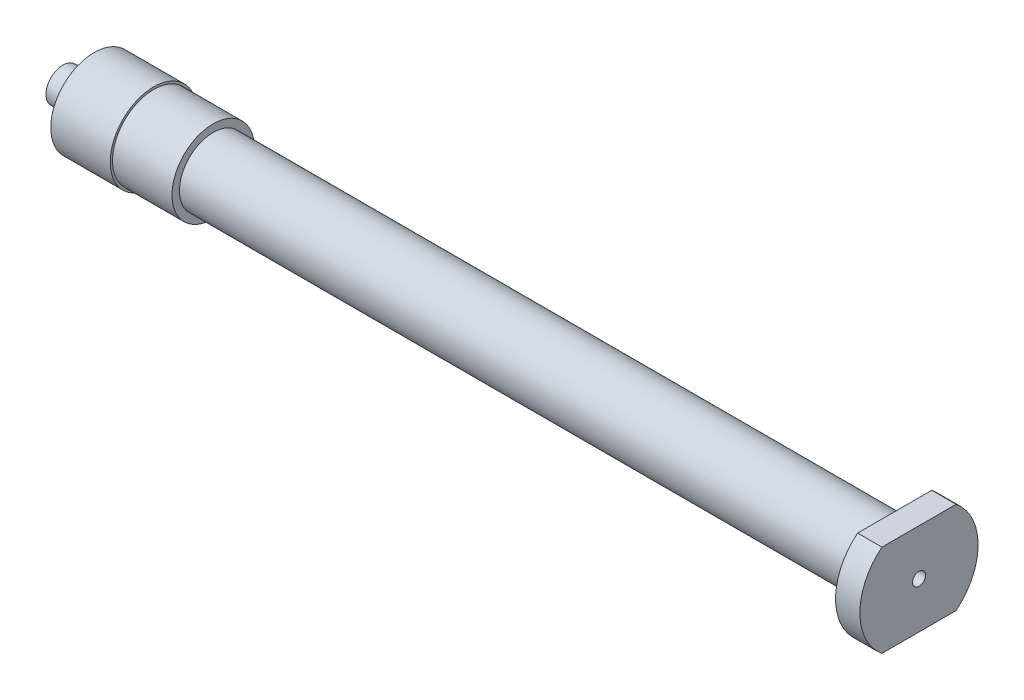
ISO-10303-21;
HEADER;
FILE_DESCRIPTION(('STEP AP214'),'2;1');
FILE_NAME('part.step','',(''),(''),'','','');
FILE_SCHEMA(('AUTOMOTIVE_DESIGN { 1 0 10303 214 1 1 1 1 }'));
ENDSEC;
DATA;
#1=APPLICATION_CONTEXT('core data for automotive mechanical design processes');
#2=APPLICATION_PROTOCOL_DEFINITION('international standard','automotive_design',2000,#1);
#3=PRODUCT_CONTEXT('',#1,'mechanical');
#4=PRODUCT('Part','Part','',(#3));
#5=PRODUCT_RELATED_PRODUCT_CATEGORY('part','',(#4));
#6=PRODUCT_DEFINITION_FORMATION('','',#4);
#7=PRODUCT_DEFINITION_CONTEXT('part definition',#1,'design');
#8=PRODUCT_DEFINITION('design','',#6,#7);
#9=PRODUCT_DEFINITION_SHAPE('','',#8);
#10=(LENGTH_UNIT() NAMED_UNIT(*) SI_UNIT(.MILLI.,.METRE.));
#11=(NAMED_UNIT(*) PLANE_ANGLE_UNIT() SI_UNIT($,.RADIAN.));
#12=(NAMED_UNIT(*) SI_UNIT($,.STERADIAN.) SOLID_ANGLE_UNIT());
#13=UNCERTAINTY_MEASURE_WITH_UNIT(LENGTH_MEASURE(1.E-05),#10,'distance_accuracy_value','');
#14=(GEOMETRIC_REPRESENTATION_CONTEXT(3) GLOBAL_UNCERTAINTY_ASSIGNED_CONTEXT((#13)) GLOBAL_UNIT_ASSIGNED_CONTEXT((#10,
#11,#12)) REPRESENTATION_CONTEXT('',''));
#15=CARTESIAN_POINT('',(0.,0.,0.));
#16=DIRECTION('',(0.,0.,1.));
#17=DIRECTION('',(1.,0.,0.));
#18=AXIS2_PLACEMENT_3D('',#15,#16,#17);
#19=CARTESIAN_POINT('',(49.2849999999998,0.,-6.805));
#20=DIRECTION('',(1.,0.,0.));
#21=DIRECTION('',(0.,0.,-1.));
#22=AXIS2_PLACEMENT_3D('',#19,#20,#21);
#23=PLANE('',#22);
#24=CARTESIAN_POINT('',(49.2849999999998,0.,0.));
#25=DIRECTION('',(1.,0.,0.));
#26=DIRECTION('',(0.,0.,-1.));
#27=AXIS2_PLACEMENT_3D('',#24,#25,#26);
#28=CIRCLE('',#27,0.75);
#29=CARTESIAN_POINT('',(49.2849999999998,0.,-0.75));
#30=VERTEX_POINT('',#29);
#31=EDGE_CURVE('E98',#30,#30,#28,.T.);
#32=ORIENTED_EDGE('',*,*,#31,.F.);
#33=EDGE_LOOP('',(#32));
#34=FACE_BOUND('',#33,.T.);
#35=CARTESIAN_POINT('',(49.2849999999998,0.,0.));
#36=DIRECTION('',(1.,0.,0.));
#37=DIRECTION('',(0.,0.,-1.));
#38=AXIS2_PLACEMENT_3D('',#35,#36,#37);
#39=CIRCLE('',#38,6.805);
#40=CARTESIAN_POINT('',(49.2849999999998,5.3,4.26825784132121));
#41=VERTEX_POINT('',#40);
#42=CARTESIAN_POINT('',(49.2849999999998,-5.3,4.26825784132121));
#43=VERTEX_POINT('',#42);
#44=EDGE_CURVE('E86',#41,#43,#39,.T.);
#45=ORIENTED_EDGE('',*,*,#44,.T.);
#46=DIRECTION('',(0.,0.,-1.));
#47=VECTOR('',#46,1.);
#48=CARTESIAN_POINT('',(49.2849999999998,-5.3,7.50000000000001));
#49=LINE('',#48,#47);
#50=CARTESIAN_POINT('',(49.2849999999998,-5.3,-4.26825784132121));
#51=VERTEX_POINT('',#50);
#52=EDGE_CURVE('E358',#43,#51,#49,.T.);
#53=ORIENTED_EDGE('',*,*,#52,.T.);
#54=CARTESIAN_POINT('',(49.2849999999998,5.3,-4.26825784132121));
#55=VERTEX_POINT('',#54);
#56=EDGE_CURVE('E89',#51,#55,#39,.T.);
#57=ORIENTED_EDGE('',*,*,#56,.T.);
#58=DIRECTION('',(0.,0.,1.));
#59=VECTOR('',#58,1.);
#60=CARTESIAN_POINT('',(49.2849999999998,5.3,7.50000000000001));
#61=LINE('',#60,#59);
#62=EDGE_CURVE('E356',#55,#41,#61,.T.);
#63=ORIENTED_EDGE('',*,*,#62,.T.);
#64=EDGE_LOOP('',(#45,#53,#57,#63));
#65=FACE_BOUND('',#64,.T.);
#66=ADVANCED_FACE('F34',(#34,#65),#23,.T.);
#67=CARTESIAN_POINT('',(49.2849999999998,0.,0.));
#68=DIRECTION('',(1.,0.,0.));
#69=DIRECTION('',(0.,0.,-1.));
#70=AXIS2_PLACEMENT_3D('',#67,#68,#69);
#71=CYLINDRICAL_SURFACE('',#70,6.805);
#72=ORIENTED_EDGE('',*,*,#56,.F.);
#73=DIRECTION('',(1.,0.,0.));
#74=VECTOR('',#73,1.);
#75=CARTESIAN_POINT('',(49.2849999999998,-5.3,-4.26825784132121));
#76=LINE('',#75,#74);
#77=CARTESIAN_POINT('',(46.4849999999998,-5.3,-4.26825784132121));
#78=VERTEX_POINT('',#77);
#79=EDGE_CURVE('E351',#51,#78,#76,.F.);
#80=ORIENTED_EDGE('',*,*,#79,.T.);
#81=CARTESIAN_POINT('',(46.4849999999998,0.,0.));
#82=DIRECTION('',(1.,0.,0.));
#83=DIRECTION('',(0.,0.,-1.));
#84=AXIS2_PLACEMENT_3D('',#81,#82,#83);
#85=CIRCLE('',#84,6.805);
#86=CARTESIAN_POINT('',(46.4849999999998,5.3,-4.26825784132121));
#87=VERTEX_POINT('',#86);
#88=EDGE_CURVE('E90',#78,#87,#85,.T.);
#89=ORIENTED_EDGE('',*,*,#88,.T.);
#90=DIRECTION('',(1.,0.,0.));
#91=VECTOR('',#90,1.);
#92=CARTESIAN_POINT('',(49.2849999999998,5.3,-4.26825784132121));
#93=LINE('',#92,#91);
#94=EDGE_CURVE('E56',#87,#55,#93,.T.);
#95=ORIENTED_EDGE('',*,*,#94,.T.);
#96=EDGE_LOOP('',(#72,#80,#89,#95));
#97=FACE_BOUND('',#96,.T.);
#98=ADVANCED_FACE('F139',(#97),#71,.T.);
#99=CARTESIAN_POINT('',(46.4849999999998,5.3,4.26825784132121));
#100=VERTEX_POINT('',#99);
#101=CARTESIAN_POINT('',(46.4849999999998,-5.3,4.26825784132121));
#102=VERTEX_POINT('',#101);
#103=EDGE_CURVE('E84',#100,#102,#85,.T.);
#104=ORIENTED_EDGE('',*,*,#103,.T.);
#105=DIRECTION('',(1.,0.,0.));
#106=VECTOR('',#105,1.);
#107=CARTESIAN_POINT('',(49.2849999999998,-5.3,4.26825784132121));
#108=LINE('',#107,#106);
#109=EDGE_CURVE('E49',#102,#43,#108,.T.);
#110=ORIENTED_EDGE('',*,*,#109,.T.);
#111=ORIENTED_EDGE('',*,*,#44,.F.);
#112=DIRECTION('',(1.,0.,0.));
#113=VECTOR('',#112,1.);
#114=CARTESIAN_POINT('',(49.2849999999998,5.3,4.26825784132121));
#115=LINE('',#114,#113);
#116=EDGE_CURVE('E73',#41,#100,#115,.F.);
#117=ORIENTED_EDGE('',*,*,#116,.T.);
#118=EDGE_LOOP('',(#104,#110,#111,#117));
#119=FACE_BOUND('',#118,.T.);
#120=ADVANCED_FACE('F83',(#119),#71,.T.);
#121=CARTESIAN_POINT('',(46.4849999999998,0.,-3.88499999999999));
#122=DIRECTION('',(-1.,0.,0.));
#123=DIRECTION('',(0.,0.,1.));
#124=AXIS2_PLACEMENT_3D('',#121,#122,#123);
#125=PLANE('',#124);
#126=CARTESIAN_POINT('',(46.4849999999999,0.,0.));
#127=DIRECTION('',(1.,0.,0.));
#128=DIRECTION('',(0.,0.,-1.));
#129=AXIS2_PLACEMENT_3D('',#126,#127,#128);
#130=CIRCLE('',#129,3.88499999999999);
#131=CARTESIAN_POINT('',(46.4849999999999,0.,-3.88499999999999));
#132=VERTEX_POINT('',#131);
#133=EDGE_CURVE('E94',#132,#132,#130,.T.);
#134=ORIENTED_EDGE('',*,*,#133,.T.);
#135=EDGE_LOOP('',(#134));
#136=FACE_BOUND('',#135,.T.);
#137=ORIENTED_EDGE('',*,*,#88,.F.);
#138=DIRECTION('',(0.,0.,1.));
#139=VECTOR('',#138,1.);
#140=CARTESIAN_POINT('',(46.4849999999998,-5.3,-3.88499999999999));
#141=LINE('',#140,#139);
#142=EDGE_CURVE('E11',#78,#102,#141,.T.);
#143=ORIENTED_EDGE('',*,*,#142,.T.);
#144=ORIENTED_EDGE('',*,*,#103,.F.);
#145=DIRECTION('',(0.,0.,-1.));
#146=VECTOR('',#145,1.);
#147=CARTESIAN_POINT('',(46.4849999999998,5.3,-3.88499999999999));
#148=LINE('',#147,#146);
#149=EDGE_CURVE('E42',#100,#87,#148,.T.);
#150=ORIENTED_EDGE('',*,*,#149,.T.);
#151=EDGE_LOOP('',(#137,#143,#144,#150));
#152=FACE_BOUND('',#151,.T.);
#153=ADVANCED_FACE('F88',(#136,#152),#125,.T.);
#154=CARTESIAN_POINT('',(49.2849999999998,0.,0.));
#155=DIRECTION('',(1.,0.,0.));
#156=DIRECTION('',(0.,0.,-1.));
#157=AXIS2_PLACEMENT_3D('',#154,#155,#156);
#158=CYLINDRICAL_SURFACE('',#157,5.);
#159=CARTESIAN_POINT('',(-45.6850000000002,0.,0.));
#160=DIRECTION('',(1.,0.,0.));
#161=DIRECTION('',(0.,0.,-1.));
#162=AXIS2_PLACEMENT_3D('',#159,#160,#161);
#163=CIRCLE('',#162,5.00000000000001);
#164=CARTESIAN_POINT('',(-45.6850000000002,0.,-5.));
#165=VERTEX_POINT('',#164);
#166=EDGE_CURVE('E79',#165,#165,#163,.T.);
#167=ORIENTED_EDGE('',*,*,#166,.T.);
#168=EDGE_LOOP('',(#167));
#169=FACE_BOUND('',#168,.T.);
#170=CARTESIAN_POINT('',(-38.8350000000002,0.,0.));
#171=DIRECTION('',(1.,0.,0.));
#172=DIRECTION('',(0.,0.,-1.));
#173=AXIS2_PLACEMENT_3D('',#170,#171,#172);
#174=CIRCLE('',#173,4.99999999999999);
#175=CARTESIAN_POINT('',(-38.8350000000002,0.,-4.99999999999998));
#176=VERTEX_POINT('',#175);
#177=EDGE_CURVE('E348',#176,#176,#174,.T.);
#178=ORIENTED_EDGE('',*,*,#177,.F.);
#179=EDGE_LOOP('',(#178));
#180=FACE_BOUND('',#179,.T.);
#181=ADVANCED_FACE('F36',(#169,#180),#158,.T.);
#182=CARTESIAN_POINT('',(-45.6850000000002,0.,-4.09999999999998));
#183=DIRECTION('',(-1.,0.,0.));
#184=DIRECTION('',(0.,0.,1.));
#185=AXIS2_PLACEMENT_3D('',#182,#183,#184);
#186=PLANE('',#185);
#187=CARTESIAN_POINT('',(-45.6850000000002,0.,0.));
#188=DIRECTION('',(1.,0.,0.));
#189=DIRECTION('',(0.,0.,-1.));
#190=AXIS2_PLACEMENT_3D('',#187,#188,#189);
#191=CIRCLE('',#190,4.09999999999999);
#192=CARTESIAN_POINT('',(-45.6850000000002,0.,-4.09999999999998));
#193=VERTEX_POINT('',#192);
#194=EDGE_CURVE('E119',#193,#193,#191,.T.);
#195=ORIENTED_EDGE('',*,*,#194,.T.);
#196=EDGE_LOOP('',(#195));
#197=FACE_BOUND('',#196,.T.);
#198=ORIENTED_EDGE('',*,*,#166,.F.);
#199=EDGE_LOOP('',(#198));
#200=FACE_BOUND('',#199,.T.);
#201=ADVANCED_FACE('F127',(#197,#200),#186,.T.);
#202=CARTESIAN_POINT('',(49.2849999999998,0.,0.));
#203=DIRECTION('',(1.,0.,0.));
#204=DIRECTION('',(0.,0.,-1.));
#205=AXIS2_PLACEMENT_3D('',#202,#203,#204);
#206=CYLINDRICAL_SURFACE('',#205,4.09999999999999);
#207=CARTESIAN_POINT('',(-42.1850000000002,0.,0.));
#208=DIRECTION('',(1.,0.,0.));
#209=DIRECTION('',(0.,0.,-1.));
#210=AXIS2_PLACEMENT_3D('',#207,#208,#209);
#211=CIRCLE('',#210,4.09999999999999);
#212=CARTESIAN_POINT('',(-42.1850000000002,0.,-4.09999999999998));
#213=VERTEX_POINT('',#212);
#214=EDGE_CURVE('E116',#213,#213,#211,.T.);
#215=ORIENTED_EDGE('',*,*,#214,.T.);
#216=EDGE_LOOP('',(#215));
#217=FACE_BOUND('',#216,.T.);
#218=ORIENTED_EDGE('',*,*,#194,.F.);
#219=EDGE_LOOP('',(#218));
#220=FACE_BOUND('',#219,.T.);
#221=ADVANCED_FACE('F129',(#217,#220),#206,.F.);
#222=CARTESIAN_POINT('',(-42.1850000000001,0.,-2.32209523290953));
#223=DIRECTION('',(-1.,0.,0.));
#224=DIRECTION('',(0.,0.,1.));
#225=AXIS2_PLACEMENT_3D('',#222,#223,#224);
#226=PLANE('',#225);
#227=CARTESIAN_POINT('',(-42.1850000000002,0.,0.));
#228=DIRECTION('',(1.,0.,0.));
#229=DIRECTION('',(0.,0.,-1.));
#230=AXIS2_PLACEMENT_3D('',#227,#228,#229);
#231=CIRCLE('',#230,2.32209523290954);
#232=CARTESIAN_POINT('',(-42.1850000000002,0.,-2.32209523290953));
#233=VERTEX_POINT('',#232);
#234=EDGE_CURVE('E113',#233,#233,#231,.T.);
#235=ORIENTED_EDGE('',*,*,#234,.T.);
#236=EDGE_LOOP('',(#235));
#237=FACE_BOUND('',#236,.T.);
#238=ORIENTED_EDGE('',*,*,#214,.F.);
#239=EDGE_LOOP('',(#238));
#240=FACE_BOUND('',#239,.T.);
#241=ADVANCED_FACE('F135',(#237,#240),#226,.T.);
#242=CARTESIAN_POINT('',(-42.1850000000002,0.,0.));
#243=DIRECTION('',(1.,0.,0.));
#244=DIRECTION('',(0.,0.,-1.));
#245=AXIS2_PLACEMENT_3D('',#242,#243,#244);
#246=CONICAL_SURFACE('',#245,2.32209523290954,0.0523598775598232);
#247=CARTESIAN_POINT('',(-49.2850000000001,0.,0.));
#248=DIRECTION('',(1.,0.,0.));
#249=DIRECTION('',(0.,0.,-1.));
#250=AXIS2_PLACEMENT_3D('',#247,#248,#249);
#251=CIRCLE('',#250,1.95);
#252=CARTESIAN_POINT('',(-49.2850000000001,0.,-1.94999999999999));
#253=VERTEX_POINT('',#252);
#254=EDGE_CURVE('E110',#253,#253,#251,.T.);
#255=ORIENTED_EDGE('',*,*,#254,.T.);
#256=EDGE_LOOP('',(#255));
#257=FACE_BOUND('',#256,.T.);
#258=ORIENTED_EDGE('',*,*,#234,.F.);
#259=EDGE_LOOP('',(#258));
#260=FACE_BOUND('',#259,.T.);
#261=ADVANCED_FACE('F167',(#257,#260),#246,.T.);
#262=CARTESIAN_POINT('',(-49.2850000000001,0.,-0.599999999999988));
#263=DIRECTION('',(-1.,0.,0.));
#264=DIRECTION('',(0.,0.,1.));
#265=AXIS2_PLACEMENT_3D('',#262,#263,#264);
#266=PLANE('',#265);
#267=CARTESIAN_POINT('',(-49.2850000000001,0.,0.));
#268=DIRECTION('',(1.,0.,0.));
#269=DIRECTION('',(0.,0.,-1.));
#270=AXIS2_PLACEMENT_3D('',#267,#268,#269);
#271=CIRCLE('',#270,0.6);
#272=CARTESIAN_POINT('',(-49.2850000000001,0.,-0.599999999999988));
#273=VERTEX_POINT('',#272);
#274=EDGE_CURVE('E107',#273,#273,#271,.T.);
#275=ORIENTED_EDGE('',*,*,#274,.T.);
#276=EDGE_LOOP('',(#275));
#277=FACE_BOUND('',#276,.T.);
#278=ORIENTED_EDGE('',*,*,#254,.F.);
#279=EDGE_LOOP('',(#278));
#280=FACE_BOUND('',#279,.T.);
#281=ADVANCED_FACE('F163',(#277,#280),#266,.T.);
#282=CARTESIAN_POINT('',(49.2849999999998,0.,0.));
#283=DIRECTION('',(1.,0.,0.));
#284=DIRECTION('',(0.,0.,-1.));
#285=AXIS2_PLACEMENT_3D('',#282,#283,#284);
#286=CYLINDRICAL_SURFACE('',#285,0.599999999999999);
#287=CARTESIAN_POINT('',(-31.9850000000002,0.,0.));
#288=DIRECTION('',(1.,0.,0.));
#289=DIRECTION('',(0.,0.,-1.));
#290=AXIS2_PLACEMENT_3D('',#287,#288,#289);
#291=CIRCLE('',#290,0.599999999999998);
#292=CARTESIAN_POINT('',(-31.9850000000002,0.,-0.599999999999988));
#293=VERTEX_POINT('',#292);
#294=EDGE_CURVE('E104',#293,#293,#291,.T.);
#295=ORIENTED_EDGE('',*,*,#294,.T.);
#296=EDGE_LOOP('',(#295));
#297=FACE_BOUND('',#296,.T.);
#298=ORIENTED_EDGE('',*,*,#274,.F.);
#299=EDGE_LOOP('',(#298));
#300=FACE_BOUND('',#299,.T.);
#301=ADVANCED_FACE('F159',(#297,#300),#286,.F.);
#302=CARTESIAN_POINT('',(-31.9850000000002,0.,-0.599999999999988));
#303=DIRECTION('',(1.,0.,0.));
#304=DIRECTION('',(0.,0.,-1.));
#305=AXIS2_PLACEMENT_3D('',#302,#303,#304);
#306=PLANE('',#305);
#307=CARTESIAN_POINT('',(-31.9850000000002,0.,0.));
#308=DIRECTION('',(1.,0.,0.));
#309=DIRECTION('',(0.,0.,-1.));
#310=AXIS2_PLACEMENT_3D('',#307,#308,#309);
#311=CIRCLE('',#310,0.75);
#312=CARTESIAN_POINT('',(-31.9850000000002,0.,-0.74999999999999));
#313=VERTEX_POINT('',#312);
#314=EDGE_CURVE('E101',#313,#313,#311,.T.);
#315=ORIENTED_EDGE('',*,*,#314,.T.);
#316=EDGE_LOOP('',(#315));
#317=FACE_BOUND('',#316,.T.);
#318=ORIENTED_EDGE('',*,*,#294,.F.);
#319=EDGE_LOOP('',(#318));
#320=FACE_BOUND('',#319,.T.);
#321=ADVANCED_FACE('F155',(#317,#320),#306,.T.);
#322=CARTESIAN_POINT('',(49.2849999999998,0.,0.));
#323=DIRECTION('',(1.,0.,0.));
#324=DIRECTION('',(0.,0.,-1.));
#325=AXIS2_PLACEMENT_3D('',#322,#323,#324);
#326=CYLINDRICAL_SURFACE('',#325,0.75);
#327=ORIENTED_EDGE('',*,*,#31,.T.);
#328=EDGE_LOOP('',(#327));
#329=FACE_BOUND('',#328,.T.);
#330=ORIENTED_EDGE('',*,*,#314,.F.);
#331=EDGE_LOOP('',(#330));
#332=FACE_BOUND('',#331,.T.);
#333=ADVANCED_FACE('F151',(#329,#332),#326,.F.);
#334=CARTESIAN_POINT('',(49.2849999999998,0.,0.));
#335=DIRECTION('',(1.,0.,0.));
#336=DIRECTION('',(0.,0.,-1.));
#337=AXIS2_PLACEMENT_3D('',#334,#335,#336);
#338=CYLINDRICAL_SURFACE('',#337,3.88499999999999);
#339=CARTESIAN_POINT('',(-31.9850000000002,0.,0.));
#340=DIRECTION('',(1.,0.,0.));
#341=DIRECTION('',(0.,0.,-1.));
#342=AXIS2_PLACEMENT_3D('',#339,#340,#341);
#343=CIRCLE('',#342,3.885);
#344=CARTESIAN_POINT('',(-31.9850000000002,0.,-3.88499999999999));
#345=VERTEX_POINT('',#344);
#346=EDGE_CURVE('E338',#345,#345,#343,.T.);
#347=ORIENTED_EDGE('',*,*,#346,.T.);
#348=EDGE_LOOP('',(#347));
#349=FACE_BOUND('',#348,.T.);
#350=ORIENTED_EDGE('',*,*,#133,.F.);
#351=EDGE_LOOP('',(#350));
#352=FACE_BOUND('',#351,.T.);
#353=ADVANCED_FACE('F154',(#349,#352),#338,.T.);
#354=CARTESIAN_POINT('',(-31.9850000000002,0.,-4.73999999999998));
#355=DIRECTION('',(1.,0.,0.));
#356=DIRECTION('',(0.,0.,-1.));
#357=AXIS2_PLACEMENT_3D('',#354,#355,#356);
#358=PLANE('',#357);
#359=CARTESIAN_POINT('',(-31.9850000000002,0.,0.));
#360=DIRECTION('',(1.,0.,0.));
#361=DIRECTION('',(0.,0.,-1.));
#362=AXIS2_PLACEMENT_3D('',#359,#360,#361);
#363=CIRCLE('',#362,4.73999999999999);
#364=CARTESIAN_POINT('',(-31.9850000000002,0.,-4.73999999999998));
#365=VERTEX_POINT('',#364);
#366=EDGE_CURVE('E340',#365,#365,#363,.T.);
#367=ORIENTED_EDGE('',*,*,#366,.T.);
#368=EDGE_LOOP('',(#367));
#369=FACE_BOUND('',#368,.T.);
#370=ORIENTED_EDGE('',*,*,#346,.F.);
#371=EDGE_LOOP('',(#370));
#372=FACE_BOUND('',#371,.T.);
#373=ADVANCED_FACE('F210',(#369,#372),#358,.T.);
#374=CARTESIAN_POINT('',(49.2849999999998,0.,0.));
#375=DIRECTION('',(1.,0.,0.));
#376=DIRECTION('',(0.,0.,-1.));
#377=AXIS2_PLACEMENT_3D('',#374,#375,#376);
#378=CYLINDRICAL_SURFACE('',#377,4.73999999999999);
#379=CARTESIAN_POINT('',(-38.8350000000002,0.,0.));
#380=DIRECTION('',(1.,0.,0.));
#381=DIRECTION('',(0.,0.,-1.));
#382=AXIS2_PLACEMENT_3D('',#379,#380,#381);
#383=CIRCLE('',#382,4.73999999999999);
#384=CARTESIAN_POINT('',(-38.8350000000002,0.,-4.73999999999998));
#385=VERTEX_POINT('',#384);
#386=EDGE_CURVE('E343',#385,#385,#383,.T.);
#387=ORIENTED_EDGE('',*,*,#386,.T.);
#388=EDGE_LOOP('',(#387));
#389=FACE_BOUND('',#388,.T.);
#390=ORIENTED_EDGE('',*,*,#366,.F.);
#391=EDGE_LOOP('',(#390));
#392=FACE_BOUND('',#391,.T.);
#393=ADVANCED_FACE('F219',(#389,#392),#378,.T.);
#394=CARTESIAN_POINT('',(-38.8350000000002,0.,-4.73999999999998));
#395=DIRECTION('',(1.,0.,0.));
#396=DIRECTION('',(0.,0.,-1.));
#397=AXIS2_PLACEMENT_3D('',#394,#395,#396);
#398=PLANE('',#397);
#399=ORIENTED_EDGE('',*,*,#177,.T.);
#400=EDGE_LOOP('',(#399));
#401=FACE_BOUND('',#400,.T.);
#402=ORIENTED_EDGE('',*,*,#386,.F.);
#403=EDGE_LOOP('',(#402));
#404=FACE_BOUND('',#403,.T.);
#405=ADVANCED_FACE('F227',(#401,#404),#398,.T.);
#406=CARTESIAN_POINT('',(22.5233639957534,5.3,7.50000000000001));
#407=DIRECTION('',(0.,1.,0.));
#408=DIRECTION('',(0.,0.,1.));
#409=AXIS2_PLACEMENT_3D('',#406,#407,#408);
#410=PLANE('',#409);
#411=ORIENTED_EDGE('',*,*,#62,.F.);
#412=ORIENTED_EDGE('',*,*,#94,.F.);
#413=ORIENTED_EDGE('',*,*,#149,.F.);
#414=ORIENTED_EDGE('',*,*,#116,.F.);
#415=EDGE_LOOP('',(#411,#412,#413,#414));
#416=FACE_BOUND('',#415,.T.);
#417=ADVANCED_FACE('F72',(#416),#410,.T.);
#418=CARTESIAN_POINT('',(22.5233639957534,-5.3,7.50000000000001));
#419=DIRECTION('',(0.,-1.,0.));
#420=DIRECTION('',(0.,0.,-1.));
#421=AXIS2_PLACEMENT_3D('',#418,#419,#420);
#422=PLANE('',#421);
#423=ORIENTED_EDGE('',*,*,#52,.F.);
#424=ORIENTED_EDGE('',*,*,#109,.F.);
#425=ORIENTED_EDGE('',*,*,#142,.F.);
#426=ORIENTED_EDGE('',*,*,#79,.F.);
#427=EDGE_LOOP('',(#423,#424,#425,#426));
#428=FACE_BOUND('',#427,.T.);
#429=ADVANCED_FACE('F243',(#428),#422,.T.);
#430=CLOSED_SHELL('',(#66,#98,#120,#153,#181,#201,#221,#241,#261,#281,#301,#321,#333,#353,#373,
#393,#405,#417,#429));
#431=MANIFOLD_SOLID_BREP('B2',#430);
#432=ADVANCED_BREP_SHAPE_REPRESENTATION('',(#18,#431),#14);
#433=SHAPE_DEFINITION_REPRESENTATION(#9,#432);
ENDSEC;
END-ISO-10303-21;
